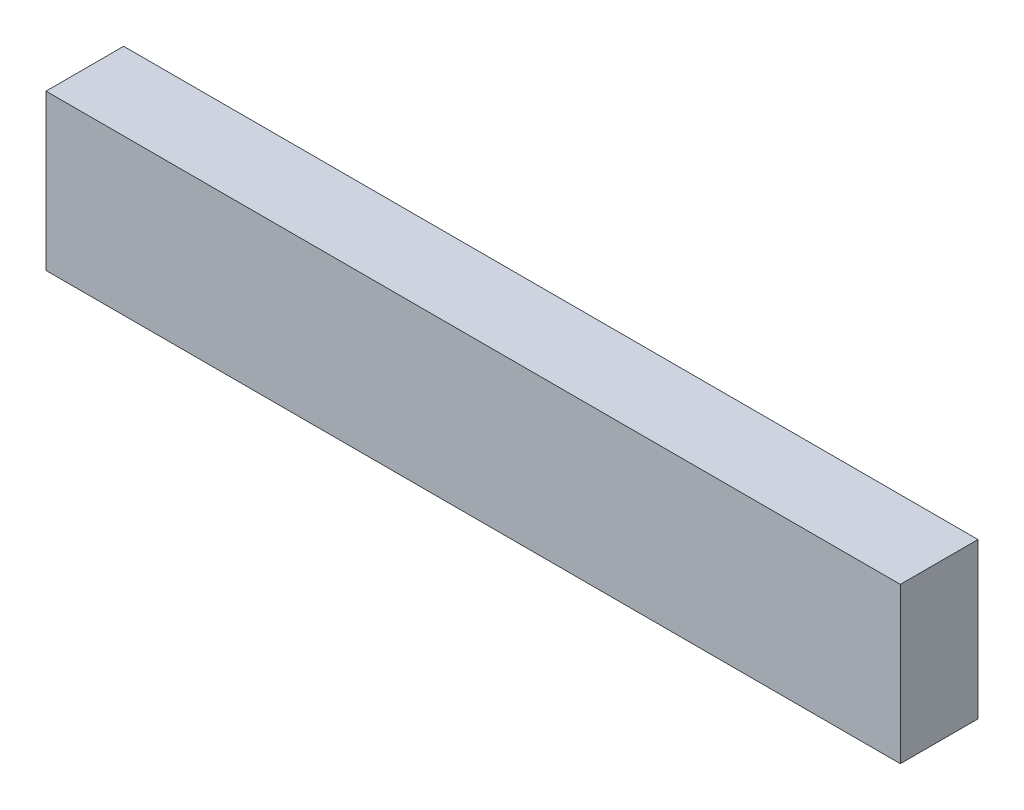
ISO-10303-21;
HEADER;
FILE_DESCRIPTION(('STEP AP214'),'2;1');
FILE_NAME('part.step','',(''),(''),'','','');
FILE_SCHEMA(('AUTOMOTIVE_DESIGN { 1 0 10303 214 1 1 1 1 }'));
ENDSEC;
DATA;
#1=APPLICATION_CONTEXT('core data for automotive mechanical design processes');
#2=APPLICATION_PROTOCOL_DEFINITION('international standard','automotive_design',2000,#1);
#3=PRODUCT_CONTEXT('',#1,'mechanical');
#4=PRODUCT('Part','Part','',(#3));
#5=PRODUCT_RELATED_PRODUCT_CATEGORY('part','',(#4));
#6=PRODUCT_DEFINITION_FORMATION('','',#4);
#7=PRODUCT_DEFINITION_CONTEXT('part definition',#1,'design');
#8=PRODUCT_DEFINITION('design','',#6,#7);
#9=PRODUCT_DEFINITION_SHAPE('','',#8);
#10=(LENGTH_UNIT() NAMED_UNIT(*) SI_UNIT(.MILLI.,.METRE.));
#11=(NAMED_UNIT(*) PLANE_ANGLE_UNIT() SI_UNIT($,.RADIAN.));
#12=(NAMED_UNIT(*) SI_UNIT($,.STERADIAN.) SOLID_ANGLE_UNIT());
#13=UNCERTAINTY_MEASURE_WITH_UNIT(LENGTH_MEASURE(1.E-05),#10,'distance_accuracy_value','');
#14=(GEOMETRIC_REPRESENTATION_CONTEXT(3) GLOBAL_UNCERTAINTY_ASSIGNED_CONTEXT((#13)) GLOBAL_UNIT_ASSIGNED_CONTEXT((#10,
#11,#12)) REPRESENTATION_CONTEXT('',''));
#15=CARTESIAN_POINT('',(0.,0.,0.));
#16=DIRECTION('',(0.,0.,1.));
#17=DIRECTION('',(1.,0.,0.));
#18=AXIS2_PLACEMENT_3D('',#15,#16,#17);
#19=CARTESIAN_POINT('',(220.,0.,0.));
#20=DIRECTION('',(0.,0.,-1.));
#21=DIRECTION('',(-1.,0.,0.));
#22=AXIS2_PLACEMENT_3D('',#19,#20,#21);
#23=PLANE('',#22);
#24=DIRECTION('',(0.,-1.,0.));
#25=VECTOR('',#24,1.);
#26=CARTESIAN_POINT('',(0.,0.,0.));
#27=LINE('',#26,#25);
#28=CARTESIAN_POINT('',(0.,40.,0.));
#29=VERTEX_POINT('',#28);
#30=CARTESIAN_POINT('',(0.,0.,0.));
#31=VERTEX_POINT('',#30);
#32=EDGE_CURVE('E98',#29,#31,#27,.T.);
#33=ORIENTED_EDGE('',*,*,#32,.T.);
#34=DIRECTION('',(-1.,0.,0.));
#35=VECTOR('',#34,1.);
#36=CARTESIAN_POINT('',(220.,0.,0.));
#37=LINE('',#36,#35);
#38=CARTESIAN_POINT('',(220.,0.,0.));
#39=VERTEX_POINT('',#38);
#40=EDGE_CURVE('E11',#39,#31,#37,.T.);
#41=ORIENTED_EDGE('',*,*,#40,.F.);
#42=DIRECTION('',(0.,-1.,0.));
#43=VECTOR('',#42,1.);
#44=CARTESIAN_POINT('',(220.,0.,0.));
#45=LINE('',#44,#43);
#46=CARTESIAN_POINT('',(220.,40.,0.));
#47=VERTEX_POINT('',#46);
#48=EDGE_CURVE('E86',#47,#39,#45,.T.);
#49=ORIENTED_EDGE('',*,*,#48,.F.);
#50=DIRECTION('',(-1.,0.,0.));
#51=VECTOR('',#50,1.);
#52=CARTESIAN_POINT('',(220.,40.,0.));
#53=LINE('',#52,#51);
#54=EDGE_CURVE('E94',#47,#29,#53,.T.);
#55=ORIENTED_EDGE('',*,*,#54,.T.);
#56=EDGE_LOOP('',(#33,#41,#49,#55));
#57=FACE_BOUND('',#56,.T.);
#58=ADVANCED_FACE('F35',(#57),#23,.F.);
#59=CARTESIAN_POINT('',(220.,0.,0.));
#60=DIRECTION('',(0.,1.,0.));
#61=DIRECTION('',(0.,0.,1.));
#62=AXIS2_PLACEMENT_3D('',#59,#60,#61);
#63=PLANE('',#62);
#64=DIRECTION('',(0.,0.,-1.));
#65=VECTOR('',#64,1.);
#66=CARTESIAN_POINT('',(0.,0.,0.));
#67=LINE('',#66,#65);
#68=CARTESIAN_POINT('',(0.,0.,-20.));
#69=VERTEX_POINT('',#68);
#70=EDGE_CURVE('E90',#31,#69,#67,.T.);
#71=ORIENTED_EDGE('',*,*,#70,.T.);
#72=DIRECTION('',(-1.,0.,0.));
#73=VECTOR('',#72,1.);
#74=CARTESIAN_POINT('',(220.,0.,-20.));
#75=LINE('',#74,#73);
#76=CARTESIAN_POINT('',(220.,0.,-20.));
#77=VERTEX_POINT('',#76);
#78=EDGE_CURVE('E43',#77,#69,#75,.T.);
#79=ORIENTED_EDGE('',*,*,#78,.F.);
#80=DIRECTION('',(0.,0.,-1.));
#81=VECTOR('',#80,1.);
#82=CARTESIAN_POINT('',(220.,0.,0.));
#83=LINE('',#82,#81);
#84=EDGE_CURVE('E81',#39,#77,#83,.T.);
#85=ORIENTED_EDGE('',*,*,#84,.F.);
#86=ORIENTED_EDGE('',*,*,#40,.T.);
#87=EDGE_LOOP('',(#71,#79,#85,#86));
#88=FACE_BOUND('',#87,.T.);
#89=ADVANCED_FACE('F89',(#88),#63,.F.);
#90=CARTESIAN_POINT('',(220.,0.,-20.));
#91=DIRECTION('',(0.,0.,1.));
#92=DIRECTION('',(1.,0.,0.));
#93=AXIS2_PLACEMENT_3D('',#90,#91,#92);
#94=PLANE('',#93);
#95=DIRECTION('',(0.,1.,0.));
#96=VECTOR('',#95,1.);
#97=CARTESIAN_POINT('',(0.,0.,-20.));
#98=LINE('',#97,#96);
#99=CARTESIAN_POINT('',(0.,40.,-20.));
#100=VERTEX_POINT('',#99);
#101=EDGE_CURVE('E68',#69,#100,#98,.T.);
#102=ORIENTED_EDGE('',*,*,#101,.T.);
#103=DIRECTION('',(-1.,0.,0.));
#104=VECTOR('',#103,1.);
#105=CARTESIAN_POINT('',(220.,40.,-20.));
#106=LINE('',#105,#104);
#107=CARTESIAN_POINT('',(220.,40.,-20.));
#108=VERTEX_POINT('',#107);
#109=EDGE_CURVE('E91',#108,#100,#106,.T.);
#110=ORIENTED_EDGE('',*,*,#109,.F.);
#111=DIRECTION('',(0.,1.,0.));
#112=VECTOR('',#111,1.);
#113=CARTESIAN_POINT('',(220.,0.,-20.));
#114=LINE('',#113,#112);
#115=EDGE_CURVE('E84',#77,#108,#114,.T.);
#116=ORIENTED_EDGE('',*,*,#115,.F.);
#117=ORIENTED_EDGE('',*,*,#78,.T.);
#118=EDGE_LOOP('',(#102,#110,#116,#117));
#119=FACE_BOUND('',#118,.T.);
#120=ADVANCED_FACE('F92',(#119),#94,.F.);
#121=CARTESIAN_POINT('',(220.,40.,0.));
#122=DIRECTION('',(0.,-1.,0.));
#123=DIRECTION('',(0.,0.,-1.));
#124=AXIS2_PLACEMENT_3D('',#121,#122,#123);
#125=PLANE('',#124);
#126=DIRECTION('',(0.,0.,1.));
#127=VECTOR('',#126,1.);
#128=CARTESIAN_POINT('',(0.,40.,0.));
#129=LINE('',#128,#127);
#130=EDGE_CURVE('E74',#100,#29,#129,.T.);
#131=ORIENTED_EDGE('',*,*,#130,.T.);
#132=ORIENTED_EDGE('',*,*,#54,.F.);
#133=DIRECTION('',(0.,0.,1.));
#134=VECTOR('',#133,1.);
#135=CARTESIAN_POINT('',(220.,40.,0.));
#136=LINE('',#135,#134);
#137=EDGE_CURVE('E51',#108,#47,#136,.T.);
#138=ORIENTED_EDGE('',*,*,#137,.F.);
#139=ORIENTED_EDGE('',*,*,#109,.T.);
#140=EDGE_LOOP('',(#131,#132,#138,#139));
#141=FACE_BOUND('',#140,.T.);
#142=ADVANCED_FACE('F105',(#141),#125,.F.);
#143=CARTESIAN_POINT('',(220.,0.,0.));
#144=DIRECTION('',(-1.,0.,0.));
#145=DIRECTION('',(0.,0.,1.));
#146=AXIS2_PLACEMENT_3D('',#143,#144,#145);
#147=PLANE('',#146);
#148=ORIENTED_EDGE('',*,*,#48,.T.);
#149=ORIENTED_EDGE('',*,*,#84,.T.);
#150=ORIENTED_EDGE('',*,*,#115,.T.);
#151=ORIENTED_EDGE('',*,*,#137,.T.);
#152=EDGE_LOOP('',(#148,#149,#150,#151));
#153=FACE_BOUND('',#152,.T.);
#154=ADVANCED_FACE('F82',(#153),#147,.F.);
#155=CARTESIAN_POINT('',(0.,0.,0.));
#156=DIRECTION('',(-1.,0.,0.));
#157=DIRECTION('',(0.,0.,1.));
#158=AXIS2_PLACEMENT_3D('',#155,#156,#157);
#159=PLANE('',#158);
#160=ORIENTED_EDGE('',*,*,#32,.F.);
#161=ORIENTED_EDGE('',*,*,#130,.F.);
#162=ORIENTED_EDGE('',*,*,#101,.F.);
#163=ORIENTED_EDGE('',*,*,#70,.F.);
#164=EDGE_LOOP('',(#160,#161,#162,#163));
#165=FACE_BOUND('',#164,.T.);
#166=ADVANCED_FACE('F108',(#165),#159,.T.);
#167=CLOSED_SHELL('',(#58,#89,#120,#142,#154,#166));
#168=MANIFOLD_SOLID_BREP('B2',#167);
#169=ADVANCED_BREP_SHAPE_REPRESENTATION('',(#18,#168),#14);
#170=SHAPE_DEFINITION_REPRESENTATION(#9,#169);
ENDSEC;
END-ISO-10303-21;
